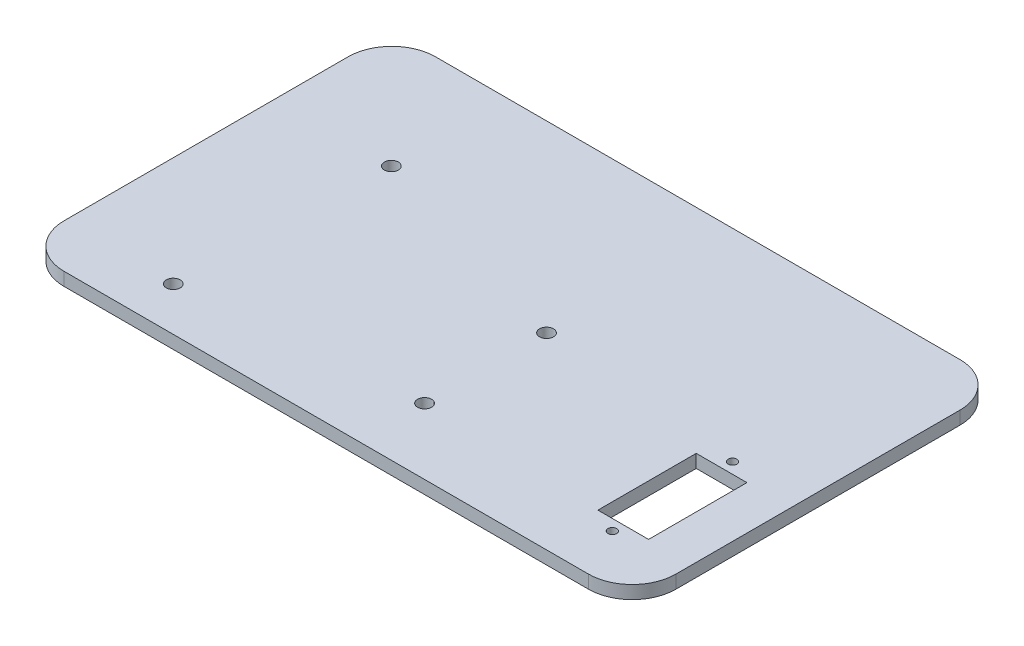
ISO-10303-21;
HEADER;
FILE_DESCRIPTION(('STEP AP214'),'2;1');
FILE_NAME('part.step','',(''),(''),'','','');
FILE_SCHEMA(('AUTOMOTIVE_DESIGN { 1 0 10303 214 1 1 1 1 }'));
ENDSEC;
DATA;
#1=APPLICATION_CONTEXT('core data for automotive mechanical design processes');
#2=APPLICATION_PROTOCOL_DEFINITION('international standard','automotive_design',2000,#1);
#3=PRODUCT_CONTEXT('',#1,'mechanical');
#4=PRODUCT('Part','Part','',(#3));
#5=PRODUCT_RELATED_PRODUCT_CATEGORY('part','',(#4));
#6=PRODUCT_DEFINITION_FORMATION('','',#4);
#7=PRODUCT_DEFINITION_CONTEXT('part definition',#1,'design');
#8=PRODUCT_DEFINITION('design','',#6,#7);
#9=PRODUCT_DEFINITION_SHAPE('','',#8);
#10=(LENGTH_UNIT() NAMED_UNIT(*) SI_UNIT(.MILLI.,.METRE.));
#11=(NAMED_UNIT(*) PLANE_ANGLE_UNIT() SI_UNIT($,.RADIAN.));
#12=(NAMED_UNIT(*) SI_UNIT($,.STERADIAN.) SOLID_ANGLE_UNIT());
#13=UNCERTAINTY_MEASURE_WITH_UNIT(LENGTH_MEASURE(1.E-05),#10,'distance_accuracy_value','');
#14=(GEOMETRIC_REPRESENTATION_CONTEXT(3) GLOBAL_UNCERTAINTY_ASSIGNED_CONTEXT((#13)) GLOBAL_UNIT_ASSIGNED_CONTEXT((#10,
#11,#12)) REPRESENTATION_CONTEXT('',''));
#15=CARTESIAN_POINT('',(0.,0.,0.));
#16=DIRECTION('',(0.,0.,1.));
#17=DIRECTION('',(1.,0.,0.));
#18=AXIS2_PLACEMENT_3D('',#15,#16,#17);
#19=CARTESIAN_POINT('',(-70.,3.,-42.5));
#20=DIRECTION('',(1.,0.,0.));
#21=DIRECTION('',(0.,0.,-1.));
#22=AXIS2_PLACEMENT_3D('',#19,#20,#21);
#23=PLANE('',#22);
#24=DIRECTION('',(0.,0.,1.));
#25=VECTOR('',#24,1.);
#26=CARTESIAN_POINT('',(-70.,3.,-42.5));
#27=LINE('',#26,#25);
#28=CARTESIAN_POINT('',(-70.,3.,-32.5));
#29=VERTEX_POINT('',#28);
#30=CARTESIAN_POINT('',(-70.,3.,32.5));
#31=VERTEX_POINT('',#30);
#32=EDGE_CURVE('E189',#29,#31,#27,.T.);
#33=ORIENTED_EDGE('',*,*,#32,.F.);
#34=DIRECTION('',(0.,-1.,0.));
#35=VECTOR('',#34,1.);
#36=CARTESIAN_POINT('',(-70.,0.,-32.5));
#37=LINE('',#36,#35);
#38=CARTESIAN_POINT('',(-70.,0.,-32.5));
#39=VERTEX_POINT('',#38);
#40=EDGE_CURVE('E221',#29,#39,#37,.T.);
#41=ORIENTED_EDGE('',*,*,#40,.T.);
#42=DIRECTION('',(0.,0.,1.));
#43=VECTOR('',#42,1.);
#44=CARTESIAN_POINT('',(-70.,0.,-42.5));
#45=LINE('',#44,#43);
#46=CARTESIAN_POINT('',(-70.,0.,32.5));
#47=VERTEX_POINT('',#46);
#48=EDGE_CURVE('E168',#39,#47,#45,.T.);
#49=ORIENTED_EDGE('',*,*,#48,.T.);
#50=DIRECTION('',(0.,-1.,0.));
#51=VECTOR('',#50,1.);
#52=CARTESIAN_POINT('',(-70.,3.,32.5));
#53=LINE('',#52,#51);
#54=EDGE_CURVE('E216',#47,#31,#53,.F.);
#55=ORIENTED_EDGE('',*,*,#54,.T.);
#56=EDGE_LOOP('',(#33,#41,#49,#55));
#57=FACE_BOUND('',#56,.T.);
#58=ADVANCED_FACE('F36',(#57),#23,.F.);
#59=CARTESIAN_POINT('',(-70.,3.,42.5));
#60=DIRECTION('',(0.,0.,-1.));
#61=DIRECTION('',(-1.,0.,0.));
#62=AXIS2_PLACEMENT_3D('',#59,#60,#61);
#63=PLANE('',#62);
#64=DIRECTION('',(1.,0.,0.));
#65=VECTOR('',#64,1.);
#66=CARTESIAN_POINT('',(-70.,0.,42.5));
#67=LINE('',#66,#65);
#68=CARTESIAN_POINT('',(-60.,0.,42.5));
#69=VERTEX_POINT('',#68);
#70=CARTESIAN_POINT('',(60.,0.,42.5));
#71=VERTEX_POINT('',#70);
#72=EDGE_CURVE('E203',#69,#71,#67,.T.);
#73=ORIENTED_EDGE('',*,*,#72,.T.);
#74=DIRECTION('',(0.,-1.,0.));
#75=VECTOR('',#74,1.);
#76=CARTESIAN_POINT('',(60.,3.,42.5));
#77=LINE('',#76,#75);
#78=CARTESIAN_POINT('',(60.,3.,42.5));
#79=VERTEX_POINT('',#78);
#80=EDGE_CURVE('E44',#71,#79,#77,.F.);
#81=ORIENTED_EDGE('',*,*,#80,.T.);
#82=DIRECTION('',(1.,0.,0.));
#83=VECTOR('',#82,1.);
#84=CARTESIAN_POINT('',(-70.,3.,42.5));
#85=LINE('',#84,#83);
#86=CARTESIAN_POINT('',(-60.,3.,42.5));
#87=VERTEX_POINT('',#86);
#88=EDGE_CURVE('E191',#87,#79,#85,.T.);
#89=ORIENTED_EDGE('',*,*,#88,.F.);
#90=DIRECTION('',(0.,-1.,0.));
#91=VECTOR('',#90,1.);
#92=CARTESIAN_POINT('',(-60.,3.,42.5));
#93=LINE('',#92,#91);
#94=EDGE_CURVE('E201',#87,#69,#93,.T.);
#95=ORIENTED_EDGE('',*,*,#94,.T.);
#96=EDGE_LOOP('',(#73,#81,#89,#95));
#97=FACE_BOUND('',#96,.T.);
#98=ADVANCED_FACE('F246',(#97),#63,.F.);
#99=CARTESIAN_POINT('',(70.,3.,-42.5));
#100=DIRECTION('',(1.,0.,0.));
#101=DIRECTION('',(0.,0.,-1.));
#102=AXIS2_PLACEMENT_3D('',#99,#100,#101);
#103=PLANE('',#102);
#104=DIRECTION('',(0.,0.,1.));
#105=VECTOR('',#104,1.);
#106=CARTESIAN_POINT('',(70.,3.,-42.5));
#107=LINE('',#106,#105);
#108=CARTESIAN_POINT('',(70.,3.,-32.5));
#109=VERTEX_POINT('',#108);
#110=CARTESIAN_POINT('',(70.,3.,32.5));
#111=VERTEX_POINT('',#110);
#112=EDGE_CURVE('E195',#109,#111,#107,.T.);
#113=ORIENTED_EDGE('',*,*,#112,.T.);
#114=DIRECTION('',(0.,-1.,0.));
#115=VECTOR('',#114,1.);
#116=CARTESIAN_POINT('',(70.,0.,32.5));
#117=LINE('',#116,#115);
#118=CARTESIAN_POINT('',(70.,0.,32.5));
#119=VERTEX_POINT('',#118);
#120=EDGE_CURVE('E239',#111,#119,#117,.T.);
#121=ORIENTED_EDGE('',*,*,#120,.T.);
#122=DIRECTION('',(0.,0.,1.));
#123=VECTOR('',#122,1.);
#124=CARTESIAN_POINT('',(70.,0.,-42.5));
#125=LINE('',#124,#123);
#126=CARTESIAN_POINT('',(70.,0.,-32.5));
#127=VERTEX_POINT('',#126);
#128=EDGE_CURVE('E206',#127,#119,#125,.T.);
#129=ORIENTED_EDGE('',*,*,#128,.F.);
#130=DIRECTION('',(0.,-1.,0.));
#131=VECTOR('',#130,1.);
#132=CARTESIAN_POINT('',(70.,3.,-32.5));
#133=LINE('',#132,#131);
#134=EDGE_CURVE('E235',#127,#109,#133,.F.);
#135=ORIENTED_EDGE('',*,*,#134,.T.);
#136=EDGE_LOOP('',(#113,#121,#129,#135));
#137=FACE_BOUND('',#136,.T.);
#138=ADVANCED_FACE('F258',(#137),#103,.T.);
#139=CARTESIAN_POINT('',(-70.,3.,-42.5));
#140=DIRECTION('',(0.,0.,-1.));
#141=DIRECTION('',(-1.,0.,0.));
#142=AXIS2_PLACEMENT_3D('',#139,#140,#141);
#143=PLANE('',#142);
#144=DIRECTION('',(1.,0.,0.));
#145=VECTOR('',#144,1.);
#146=CARTESIAN_POINT('',(-70.,3.,-42.5));
#147=LINE('',#146,#145);
#148=CARTESIAN_POINT('',(-60.,3.,-42.5));
#149=VERTEX_POINT('',#148);
#150=CARTESIAN_POINT('',(60.,3.,-42.5));
#151=VERTEX_POINT('',#150);
#152=EDGE_CURVE('E198',#149,#151,#147,.T.);
#153=ORIENTED_EDGE('',*,*,#152,.T.);
#154=DIRECTION('',(0.,-1.,0.));
#155=VECTOR('',#154,1.);
#156=CARTESIAN_POINT('',(60.,3.,-42.5));
#157=LINE('',#156,#155);
#158=CARTESIAN_POINT('',(60.,0.,-42.5));
#159=VERTEX_POINT('',#158);
#160=EDGE_CURVE('E230',#151,#159,#157,.T.);
#161=ORIENTED_EDGE('',*,*,#160,.T.);
#162=DIRECTION('',(1.,0.,0.));
#163=VECTOR('',#162,1.);
#164=CARTESIAN_POINT('',(-70.,0.,-42.5));
#165=LINE('',#164,#163);
#166=CARTESIAN_POINT('',(-60.,0.,-42.5));
#167=VERTEX_POINT('',#166);
#168=EDGE_CURVE('E192',#167,#159,#165,.T.);
#169=ORIENTED_EDGE('',*,*,#168,.F.);
#170=DIRECTION('',(0.,-1.,0.));
#171=VECTOR('',#170,1.);
#172=CARTESIAN_POINT('',(-60.,3.,-42.5));
#173=LINE('',#172,#171);
#174=EDGE_CURVE('E226',#167,#149,#173,.F.);
#175=ORIENTED_EDGE('',*,*,#174,.T.);
#176=EDGE_LOOP('',(#153,#161,#169,#175));
#177=FACE_BOUND('',#176,.T.);
#178=ADVANCED_FACE('F267',(#177),#143,.T.);
#179=CARTESIAN_POINT('',(0.,3.,0.));
#180=DIRECTION('',(0.,1.,0.));
#181=DIRECTION('',(0.,0.,1.));
#182=AXIS2_PLACEMENT_3D('',#179,#180,#181);
#183=PLANE('',#182);
#184=CARTESIAN_POINT('',(54.2,3.,3.74999999999998));
#185=DIRECTION('',(0.,1.,0.));
#186=DIRECTION('',(0.,0.,1.));
#187=AXIS2_PLACEMENT_3D('',#184,#185,#186);
#188=CIRCLE('',#187,0.999999999999998);
#189=CARTESIAN_POINT('',(54.2,3.,4.74999999999998));
#190=VERTEX_POINT('',#189);
#191=EDGE_CURVE('E148',#190,#190,#188,.T.);
#192=ORIENTED_EDGE('',*,*,#191,.F.);
#193=EDGE_LOOP('',(#192));
#194=FACE_BOUND('',#193,.T.);
#195=CARTESIAN_POINT('',(54.2,3.,31.25));
#196=DIRECTION('',(0.,1.,0.));
#197=DIRECTION('',(0.,0.,1.));
#198=AXIS2_PLACEMENT_3D('',#195,#196,#197);
#199=CIRCLE('',#198,0.999999999999998);
#200=CARTESIAN_POINT('',(54.2,3.,32.25));
#201=VERTEX_POINT('',#200);
#202=EDGE_CURVE('E344',#201,#201,#199,.T.);
#203=ORIENTED_EDGE('',*,*,#202,.F.);
#204=EDGE_LOOP('',(#203));
#205=FACE_BOUND('',#204,.T.);
#206=DIRECTION('',(0.,0.,1.));
#207=VECTOR('',#206,1.);
#208=CARTESIAN_POINT('',(48.4,3.,28.75));
#209=LINE('',#208,#207);
#210=CARTESIAN_POINT('',(48.4,3.,6.24999999999998));
#211=VERTEX_POINT('',#210);
#212=CARTESIAN_POINT('',(48.4,3.,28.75));
#213=VERTEX_POINT('',#212);
#214=EDGE_CURVE('E51',#211,#213,#209,.T.);
#215=ORIENTED_EDGE('',*,*,#214,.F.);
#216=DIRECTION('',(-1.,0.,0.));
#217=VECTOR('',#216,1.);
#218=CARTESIAN_POINT('',(60.,3.,6.24999999999998));
#219=LINE('',#218,#217);
#220=CARTESIAN_POINT('',(60.,3.,6.24999999999998));
#221=VERTEX_POINT('',#220);
#222=EDGE_CURVE('E142',#221,#211,#219,.T.);
#223=ORIENTED_EDGE('',*,*,#222,.F.);
#224=DIRECTION('',(0.,0.,-1.));
#225=VECTOR('',#224,1.);
#226=CARTESIAN_POINT('',(60.,3.,28.75));
#227=LINE('',#226,#225);
#228=CARTESIAN_POINT('',(60.,3.,28.75));
#229=VERTEX_POINT('',#228);
#230=EDGE_CURVE('E145',#229,#221,#227,.T.);
#231=ORIENTED_EDGE('',*,*,#230,.F.);
#232=DIRECTION('',(1.,0.,0.));
#233=VECTOR('',#232,1.);
#234=CARTESIAN_POINT('',(60.,3.,28.75));
#235=LINE('',#234,#233);
#236=EDGE_CURVE('E154',#213,#229,#235,.T.);
#237=ORIENTED_EDGE('',*,*,#236,.F.);
#238=EDGE_LOOP('',(#215,#223,#231,#237));
#239=FACE_BOUND('',#238,.T.);
#240=CARTESIAN_POINT('',(-43.4,3.,-15.8));
#241=DIRECTION('',(0.,1.,0.));
#242=DIRECTION('',(0.,0.,1.));
#243=AXIS2_PLACEMENT_3D('',#240,#241,#242);
#244=CIRCLE('',#243,1.6);
#245=CARTESIAN_POINT('',(-43.4,3.,-14.2));
#246=VERTEX_POINT('',#245);
#247=EDGE_CURVE('E169',#246,#246,#244,.T.);
#248=ORIENTED_EDGE('',*,*,#247,.F.);
#249=EDGE_LOOP('',(#248));
#250=FACE_BOUND('',#249,.T.);
#251=CARTESIAN_POINT('',(7.39999999999996,3.,27.4));
#252=DIRECTION('',(0.,1.,0.));
#253=DIRECTION('',(0.,0.,1.));
#254=AXIS2_PLACEMENT_3D('',#251,#252,#253);
#255=CIRCLE('',#254,1.60000000000001);
#256=CARTESIAN_POINT('',(7.39999999999996,3.,29.));
#257=VERTEX_POINT('',#256);
#258=EDGE_CURVE('E161',#257,#257,#255,.T.);
#259=ORIENTED_EDGE('',*,*,#258,.F.);
#260=EDGE_LOOP('',(#259));
#261=FACE_BOUND('',#260,.T.);
#262=CARTESIAN_POINT('',(-45.,3.,32.5));
#263=DIRECTION('',(0.,1.,0.));
#264=DIRECTION('',(0.,0.,1.));
#265=AXIS2_PLACEMENT_3D('',#262,#263,#264);
#266=CIRCLE('',#265,1.6);
#267=CARTESIAN_POINT('',(-45.,3.,34.1));
#268=VERTEX_POINT('',#267);
#269=EDGE_CURVE('E176',#268,#268,#266,.T.);
#270=ORIENTED_EDGE('',*,*,#269,.F.);
#271=EDGE_LOOP('',(#270));
#272=FACE_BOUND('',#271,.T.);
#273=CARTESIAN_POINT('',(7.39999999999996,3.,-0.500000000000018));
#274=DIRECTION('',(0.,1.,0.));
#275=DIRECTION('',(0.,0.,1.));
#276=AXIS2_PLACEMENT_3D('',#273,#274,#275);
#277=CIRCLE('',#276,1.60000000000001);
#278=CARTESIAN_POINT('',(7.39999999999996,3.,1.09999999999999));
#279=VERTEX_POINT('',#278);
#280=EDGE_CURVE('E181',#279,#279,#277,.T.);
#281=ORIENTED_EDGE('',*,*,#280,.F.);
#282=EDGE_LOOP('',(#281));
#283=FACE_BOUND('',#282,.T.);
#284=ORIENTED_EDGE('',*,*,#88,.T.);
#285=CARTESIAN_POINT('',(60.,3.,32.5));
#286=DIRECTION('',(0.,1.,0.));
#287=DIRECTION('',(0.,0.,1.));
#288=AXIS2_PLACEMENT_3D('',#285,#286,#287);
#289=CIRCLE('',#288,10.);
#290=EDGE_CURVE('E11',#79,#111,#289,.T.);
#291=ORIENTED_EDGE('',*,*,#290,.T.);
#292=ORIENTED_EDGE('',*,*,#112,.F.);
#293=CARTESIAN_POINT('',(60.,3.,-32.5));
#294=DIRECTION('',(0.,1.,0.));
#295=DIRECTION('',(0.,0.,1.));
#296=AXIS2_PLACEMENT_3D('',#293,#294,#295);
#297=CIRCLE('',#296,10.);
#298=EDGE_CURVE('E237',#109,#151,#297,.T.);
#299=ORIENTED_EDGE('',*,*,#298,.T.);
#300=ORIENTED_EDGE('',*,*,#152,.F.);
#301=CARTESIAN_POINT('',(-60.,3.,-32.5));
#302=DIRECTION('',(0.,1.,0.));
#303=DIRECTION('',(0.,0.,1.));
#304=AXIS2_PLACEMENT_3D('',#301,#302,#303);
#305=CIRCLE('',#304,10.);
#306=EDGE_CURVE('E228',#149,#29,#305,.T.);
#307=ORIENTED_EDGE('',*,*,#306,.T.);
#308=ORIENTED_EDGE('',*,*,#32,.T.);
#309=CARTESIAN_POINT('',(-60.,3.,32.5));
#310=DIRECTION('',(0.,1.,0.));
#311=DIRECTION('',(0.,0.,1.));
#312=AXIS2_PLACEMENT_3D('',#309,#310,#311);
#313=CIRCLE('',#312,10.);
#314=EDGE_CURVE('E219',#31,#87,#313,.T.);
#315=ORIENTED_EDGE('',*,*,#314,.T.);
#316=EDGE_LOOP('',(#284,#291,#292,#299,#300,#307,#308,#315));
#317=FACE_BOUND('',#316,.T.);
#318=ADVANCED_FACE('F252',(#194,#205,#239,#250,#261,#272,#283,#317),#183,.T.);
#319=CARTESIAN_POINT('',(0.,0.,0.));
#320=DIRECTION('',(0.,1.,0.));
#321=DIRECTION('',(0.,0.,1.));
#322=AXIS2_PLACEMENT_3D('',#319,#320,#321);
#323=PLANE('',#322);
#324=CARTESIAN_POINT('',(54.2,0.,3.74999999999998));
#325=DIRECTION('',(0.,1.,0.));
#326=DIRECTION('',(0.,0.,1.));
#327=AXIS2_PLACEMENT_3D('',#324,#325,#326);
#328=CIRCLE('',#327,0.999999999999998);
#329=CARTESIAN_POINT('',(54.2,0.,4.74999999999998));
#330=VERTEX_POINT('',#329);
#331=EDGE_CURVE('E346',#330,#330,#328,.T.);
#332=ORIENTED_EDGE('',*,*,#331,.T.);
#333=EDGE_LOOP('',(#332));
#334=FACE_BOUND('',#333,.T.);
#335=CARTESIAN_POINT('',(54.2,0.,31.25));
#336=DIRECTION('',(0.,1.,0.));
#337=DIRECTION('',(0.,0.,1.));
#338=AXIS2_PLACEMENT_3D('',#335,#336,#337);
#339=CIRCLE('',#338,0.999999999999998);
#340=CARTESIAN_POINT('',(54.2,0.,32.25));
#341=VERTEX_POINT('',#340);
#342=EDGE_CURVE('E155',#341,#341,#339,.T.);
#343=ORIENTED_EDGE('',*,*,#342,.T.);
#344=EDGE_LOOP('',(#343));
#345=FACE_BOUND('',#344,.T.);
#346=DIRECTION('',(-1.,0.,0.));
#347=VECTOR('',#346,1.);
#348=CARTESIAN_POINT('',(60.,0.,6.24999999999998));
#349=LINE('',#348,#347);
#350=CARTESIAN_POINT('',(60.,0.,6.24999999999998));
#351=VERTEX_POINT('',#350);
#352=CARTESIAN_POINT('',(48.4,0.,6.24999999999998));
#353=VERTEX_POINT('',#352);
#354=EDGE_CURVE('E132',#351,#353,#349,.T.);
#355=ORIENTED_EDGE('',*,*,#354,.T.);
#356=DIRECTION('',(0.,0.,1.));
#357=VECTOR('',#356,1.);
#358=CARTESIAN_POINT('',(48.4,0.,28.75));
#359=LINE('',#358,#357);
#360=CARTESIAN_POINT('',(48.4,0.,28.75));
#361=VERTEX_POINT('',#360);
#362=EDGE_CURVE('E126',#353,#361,#359,.T.);
#363=ORIENTED_EDGE('',*,*,#362,.T.);
#364=DIRECTION('',(1.,0.,0.));
#365=VECTOR('',#364,1.);
#366=CARTESIAN_POINT('',(60.,0.,28.75));
#367=LINE('',#366,#365);
#368=CARTESIAN_POINT('',(60.,0.,28.75));
#369=VERTEX_POINT('',#368);
#370=EDGE_CURVE('E135',#361,#369,#367,.T.);
#371=ORIENTED_EDGE('',*,*,#370,.T.);
#372=DIRECTION('',(0.,0.,-1.));
#373=VECTOR('',#372,1.);
#374=CARTESIAN_POINT('',(60.,0.,28.75));
#375=LINE('',#374,#373);
#376=EDGE_CURVE('E59',#369,#351,#375,.T.);
#377=ORIENTED_EDGE('',*,*,#376,.T.);
#378=EDGE_LOOP('',(#355,#363,#371,#377));
#379=FACE_BOUND('',#378,.T.);
#380=CARTESIAN_POINT('',(-43.4,0.,-15.8));
#381=DIRECTION('',(0.,1.,0.));
#382=DIRECTION('',(0.,0.,1.));
#383=AXIS2_PLACEMENT_3D('',#380,#381,#382);
#384=CIRCLE('',#383,1.6);
#385=CARTESIAN_POINT('',(-43.4,0.,-14.2));
#386=VERTEX_POINT('',#385);
#387=EDGE_CURVE('E165',#386,#386,#384,.T.);
#388=ORIENTED_EDGE('',*,*,#387,.T.);
#389=EDGE_LOOP('',(#388));
#390=FACE_BOUND('',#389,.T.);
#391=CARTESIAN_POINT('',(7.39999999999996,0.,27.4));
#392=DIRECTION('',(0.,1.,0.));
#393=DIRECTION('',(0.,0.,1.));
#394=AXIS2_PLACEMENT_3D('',#391,#392,#393);
#395=CIRCLE('',#394,1.60000000000001);
#396=CARTESIAN_POINT('',(7.39999999999996,0.,29.));
#397=VERTEX_POINT('',#396);
#398=EDGE_CURVE('E173',#397,#397,#395,.T.);
#399=ORIENTED_EDGE('',*,*,#398,.T.);
#400=EDGE_LOOP('',(#399));
#401=FACE_BOUND('',#400,.T.);
#402=CARTESIAN_POINT('',(-45.,0.,32.5));
#403=DIRECTION('',(0.,1.,0.));
#404=DIRECTION('',(0.,0.,1.));
#405=AXIS2_PLACEMENT_3D('',#402,#403,#404);
#406=CIRCLE('',#405,1.6);
#407=CARTESIAN_POINT('',(-45.,0.,34.1));
#408=VERTEX_POINT('',#407);
#409=EDGE_CURVE('E184',#408,#408,#406,.T.);
#410=ORIENTED_EDGE('',*,*,#409,.T.);
#411=EDGE_LOOP('',(#410));
#412=FACE_BOUND('',#411,.T.);
#413=CARTESIAN_POINT('',(7.39999999999996,0.,-0.500000000000018));
#414=DIRECTION('',(0.,1.,0.));
#415=DIRECTION('',(0.,0.,1.));
#416=AXIS2_PLACEMENT_3D('',#413,#414,#415);
#417=CIRCLE('',#416,1.60000000000001);
#418=CARTESIAN_POINT('',(7.39999999999996,0.,1.09999999999999));
#419=VERTEX_POINT('',#418);
#420=EDGE_CURVE('E172',#419,#419,#417,.T.);
#421=ORIENTED_EDGE('',*,*,#420,.T.);
#422=EDGE_LOOP('',(#421));
#423=FACE_BOUND('',#422,.T.);
#424=ORIENTED_EDGE('',*,*,#128,.T.);
#425=CARTESIAN_POINT('',(60.,0.,32.5));
#426=DIRECTION('',(0.,1.,0.));
#427=DIRECTION('',(0.,0.,1.));
#428=AXIS2_PLACEMENT_3D('',#425,#426,#427);
#429=CIRCLE('',#428,10.);
#430=EDGE_CURVE('E242',#119,#71,#429,.F.);
#431=ORIENTED_EDGE('',*,*,#430,.T.);
#432=ORIENTED_EDGE('',*,*,#72,.F.);
#433=CARTESIAN_POINT('',(-60.,0.,32.5));
#434=DIRECTION('',(0.,1.,0.));
#435=DIRECTION('',(0.,0.,1.));
#436=AXIS2_PLACEMENT_3D('',#433,#434,#435);
#437=CIRCLE('',#436,10.);
#438=EDGE_CURVE('E213',#69,#47,#437,.F.);
#439=ORIENTED_EDGE('',*,*,#438,.T.);
#440=ORIENTED_EDGE('',*,*,#48,.F.);
#441=CARTESIAN_POINT('',(-60.,0.,-32.5));
#442=DIRECTION('',(0.,1.,0.));
#443=DIRECTION('',(0.,0.,1.));
#444=AXIS2_PLACEMENT_3D('',#441,#442,#443);
#445=CIRCLE('',#444,10.);
#446=EDGE_CURVE('E224',#39,#167,#445,.F.);
#447=ORIENTED_EDGE('',*,*,#446,.T.);
#448=ORIENTED_EDGE('',*,*,#168,.T.);
#449=CARTESIAN_POINT('',(60.,0.,-32.5));
#450=DIRECTION('',(0.,1.,0.));
#451=DIRECTION('',(0.,0.,1.));
#452=AXIS2_PLACEMENT_3D('',#449,#450,#451);
#453=CIRCLE('',#452,10.);
#454=EDGE_CURVE('E233',#159,#127,#453,.F.);
#455=ORIENTED_EDGE('',*,*,#454,.T.);
#456=EDGE_LOOP('',(#424,#431,#432,#439,#440,#447,#448,#455));
#457=FACE_BOUND('',#456,.T.);
#458=ADVANCED_FACE('F139',(#334,#345,#379,#390,#401,#412,#423,#457),#323,.F.);
#459=CARTESIAN_POINT('',(7.39999999999996,0.,-0.500000000000018));
#460=DIRECTION('',(0.,1.,0.));
#461=DIRECTION('',(0.,0.,1.));
#462=AXIS2_PLACEMENT_3D('',#459,#460,#461);
#463=CYLINDRICAL_SURFACE('',#462,1.60000000000001);
#464=ORIENTED_EDGE('',*,*,#420,.F.);
#465=EDGE_LOOP('',(#464));
#466=FACE_BOUND('',#465,.T.);
#467=ORIENTED_EDGE('',*,*,#280,.T.);
#468=EDGE_LOOP('',(#467));
#469=FACE_BOUND('',#468,.T.);
#470=ADVANCED_FACE('F304',(#466,#469),#463,.F.);
#471=CARTESIAN_POINT('',(-45.,0.,32.5));
#472=DIRECTION('',(0.,1.,0.));
#473=DIRECTION('',(0.,0.,1.));
#474=AXIS2_PLACEMENT_3D('',#471,#472,#473);
#475=CYLINDRICAL_SURFACE('',#474,1.6);
#476=ORIENTED_EDGE('',*,*,#409,.F.);
#477=EDGE_LOOP('',(#476));
#478=FACE_BOUND('',#477,.T.);
#479=ORIENTED_EDGE('',*,*,#269,.T.);
#480=EDGE_LOOP('',(#479));
#481=FACE_BOUND('',#480,.T.);
#482=ADVANCED_FACE('F309',(#478,#481),#475,.F.);
#483=CARTESIAN_POINT('',(7.39999999999996,0.,27.4));
#484=DIRECTION('',(0.,1.,0.));
#485=DIRECTION('',(0.,0.,1.));
#486=AXIS2_PLACEMENT_3D('',#483,#484,#485);
#487=CYLINDRICAL_SURFACE('',#486,1.60000000000001);
#488=ORIENTED_EDGE('',*,*,#398,.F.);
#489=EDGE_LOOP('',(#488));
#490=FACE_BOUND('',#489,.T.);
#491=ORIENTED_EDGE('',*,*,#258,.T.);
#492=EDGE_LOOP('',(#491));
#493=FACE_BOUND('',#492,.T.);
#494=ADVANCED_FACE('F288',(#490,#493),#487,.F.);
#495=CARTESIAN_POINT('',(-43.4,0.,-15.8));
#496=DIRECTION('',(0.,1.,0.));
#497=DIRECTION('',(0.,0.,1.));
#498=AXIS2_PLACEMENT_3D('',#495,#496,#497);
#499=CYLINDRICAL_SURFACE('',#498,1.6);
#500=ORIENTED_EDGE('',*,*,#387,.F.);
#501=EDGE_LOOP('',(#500));
#502=FACE_BOUND('',#501,.T.);
#503=ORIENTED_EDGE('',*,*,#247,.T.);
#504=EDGE_LOOP('',(#503));
#505=FACE_BOUND('',#504,.T.);
#506=ADVANCED_FACE('F281',(#502,#505),#499,.F.);
#507=CARTESIAN_POINT('',(-60.,3.,32.5));
#508=DIRECTION('',(0.,-1.,0.));
#509=DIRECTION('',(0.,0.,-1.));
#510=AXIS2_PLACEMENT_3D('',#507,#508,#509);
#511=CYLINDRICAL_SURFACE('',#510,10.);
#512=ORIENTED_EDGE('',*,*,#314,.F.);
#513=ORIENTED_EDGE('',*,*,#54,.F.);
#514=ORIENTED_EDGE('',*,*,#438,.F.);
#515=ORIENTED_EDGE('',*,*,#94,.F.);
#516=EDGE_LOOP('',(#512,#513,#514,#515));
#517=FACE_BOUND('',#516,.T.);
#518=ADVANCED_FACE('F279',(#517),#511,.T.);
#519=CARTESIAN_POINT('',(-60.,3.,-32.5));
#520=DIRECTION('',(0.,1.,0.));
#521=DIRECTION('',(0.,0.,1.));
#522=AXIS2_PLACEMENT_3D('',#519,#520,#521);
#523=CYLINDRICAL_SURFACE('',#522,10.);
#524=ORIENTED_EDGE('',*,*,#306,.F.);
#525=ORIENTED_EDGE('',*,*,#174,.F.);
#526=ORIENTED_EDGE('',*,*,#446,.F.);
#527=ORIENTED_EDGE('',*,*,#40,.F.);
#528=EDGE_LOOP('',(#524,#525,#526,#527));
#529=FACE_BOUND('',#528,.T.);
#530=ADVANCED_FACE('F274',(#529),#523,.T.);
#531=CARTESIAN_POINT('',(60.,3.,-32.5));
#532=DIRECTION('',(0.,-1.,0.));
#533=DIRECTION('',(0.,0.,-1.));
#534=AXIS2_PLACEMENT_3D('',#531,#532,#533);
#535=CYLINDRICAL_SURFACE('',#534,10.);
#536=ORIENTED_EDGE('',*,*,#298,.F.);
#537=ORIENTED_EDGE('',*,*,#134,.F.);
#538=ORIENTED_EDGE('',*,*,#454,.F.);
#539=ORIENTED_EDGE('',*,*,#160,.F.);
#540=EDGE_LOOP('',(#536,#537,#538,#539));
#541=FACE_BOUND('',#540,.T.);
#542=ADVANCED_FACE('F265',(#541),#535,.T.);
#543=CARTESIAN_POINT('',(60.,3.,32.5));
#544=DIRECTION('',(0.,1.,0.));
#545=DIRECTION('',(0.,0.,1.));
#546=AXIS2_PLACEMENT_3D('',#543,#544,#545);
#547=CYLINDRICAL_SURFACE('',#546,10.);
#548=ORIENTED_EDGE('',*,*,#290,.F.);
#549=ORIENTED_EDGE('',*,*,#80,.F.);
#550=ORIENTED_EDGE('',*,*,#430,.F.);
#551=ORIENTED_EDGE('',*,*,#120,.F.);
#552=EDGE_LOOP('',(#548,#549,#550,#551));
#553=FACE_BOUND('',#552,.T.);
#554=ADVANCED_FACE('F38',(#553),#547,.T.);
#555=CARTESIAN_POINT('',(48.4,0.,28.75));
#556=DIRECTION('',(-1.,0.,0.));
#557=DIRECTION('',(0.,0.,1.));
#558=AXIS2_PLACEMENT_3D('',#555,#556,#557);
#559=PLANE('',#558);
#560=ORIENTED_EDGE('',*,*,#214,.T.);
#561=DIRECTION('',(0.,1.,0.));
#562=VECTOR('',#561,1.);
#563=CARTESIAN_POINT('',(48.4,0.,28.75));
#564=LINE('',#563,#562);
#565=EDGE_CURVE('E122',#361,#213,#564,.T.);
#566=ORIENTED_EDGE('',*,*,#565,.F.);
#567=ORIENTED_EDGE('',*,*,#362,.F.);
#568=DIRECTION('',(0.,1.,0.));
#569=VECTOR('',#568,1.);
#570=CARTESIAN_POINT('',(48.4,0.,6.24999999999998));
#571=LINE('',#570,#569);
#572=EDGE_CURVE('E159',#353,#211,#571,.T.);
#573=ORIENTED_EDGE('',*,*,#572,.T.);
#574=EDGE_LOOP('',(#560,#566,#567,#573));
#575=FACE_BOUND('',#574,.T.);
#576=ADVANCED_FACE('F124',(#575),#559,.F.);
#577=CARTESIAN_POINT('',(60.,0.,6.24999999999998));
#578=DIRECTION('',(0.,0.,-1.));
#579=DIRECTION('',(-1.,0.,0.));
#580=AXIS2_PLACEMENT_3D('',#577,#578,#579);
#581=PLANE('',#580);
#582=ORIENTED_EDGE('',*,*,#222,.T.);
#583=ORIENTED_EDGE('',*,*,#572,.F.);
#584=ORIENTED_EDGE('',*,*,#354,.F.);
#585=DIRECTION('',(0.,1.,0.));
#586=VECTOR('',#585,1.);
#587=CARTESIAN_POINT('',(60.,0.,6.24999999999998));
#588=LINE('',#587,#586);
#589=EDGE_CURVE('E162',#351,#221,#588,.T.);
#590=ORIENTED_EDGE('',*,*,#589,.T.);
#591=EDGE_LOOP('',(#582,#583,#584,#590));
#592=FACE_BOUND('',#591,.T.);
#593=ADVANCED_FACE('F321',(#592),#581,.F.);
#594=CARTESIAN_POINT('',(60.,0.,28.75));
#595=DIRECTION('',(1.,0.,0.));
#596=DIRECTION('',(0.,0.,-1.));
#597=AXIS2_PLACEMENT_3D('',#594,#595,#596);
#598=PLANE('',#597);
#599=ORIENTED_EDGE('',*,*,#230,.T.);
#600=ORIENTED_EDGE('',*,*,#589,.F.);
#601=ORIENTED_EDGE('',*,*,#376,.F.);
#602=DIRECTION('',(0.,1.,0.));
#603=VECTOR('',#602,1.);
#604=CARTESIAN_POINT('',(60.,0.,28.75));
#605=LINE('',#604,#603);
#606=EDGE_CURVE('E131',#369,#229,#605,.T.);
#607=ORIENTED_EDGE('',*,*,#606,.T.);
#608=EDGE_LOOP('',(#599,#600,#601,#607));
#609=FACE_BOUND('',#608,.T.);
#610=ADVANCED_FACE('F325',(#609),#598,.F.);
#611=CARTESIAN_POINT('',(60.,0.,28.75));
#612=DIRECTION('',(0.,0.,1.));
#613=DIRECTION('',(1.,0.,0.));
#614=AXIS2_PLACEMENT_3D('',#611,#612,#613);
#615=PLANE('',#614);
#616=ORIENTED_EDGE('',*,*,#236,.T.);
#617=ORIENTED_EDGE('',*,*,#606,.F.);
#618=ORIENTED_EDGE('',*,*,#370,.F.);
#619=ORIENTED_EDGE('',*,*,#565,.T.);
#620=EDGE_LOOP('',(#616,#617,#618,#619));
#621=FACE_BOUND('',#620,.T.);
#622=ADVANCED_FACE('F136',(#621),#615,.F.);
#623=CARTESIAN_POINT('',(54.2,0.,31.25));
#624=DIRECTION('',(0.,1.,0.));
#625=DIRECTION('',(0.,0.,1.));
#626=AXIS2_PLACEMENT_3D('',#623,#624,#625);
#627=CYLINDRICAL_SURFACE('',#626,0.999999999999998);
#628=ORIENTED_EDGE('',*,*,#342,.F.);
#629=EDGE_LOOP('',(#628));
#630=FACE_BOUND('',#629,.T.);
#631=ORIENTED_EDGE('',*,*,#202,.T.);
#632=EDGE_LOOP('',(#631));
#633=FACE_BOUND('',#632,.T.);
#634=ADVANCED_FACE('F324',(#630,#633),#627,.F.);
#635=CARTESIAN_POINT('',(54.2,0.,3.74999999999998));
#636=DIRECTION('',(0.,1.,0.));
#637=DIRECTION('',(0.,0.,1.));
#638=AXIS2_PLACEMENT_3D('',#635,#636,#637);
#639=CYLINDRICAL_SURFACE('',#638,0.999999999999998);
#640=ORIENTED_EDGE('',*,*,#331,.F.);
#641=EDGE_LOOP('',(#640));
#642=FACE_BOUND('',#641,.T.);
#643=ORIENTED_EDGE('',*,*,#191,.T.);
#644=EDGE_LOOP('',(#643));
#645=FACE_BOUND('',#644,.T.);
#646=ADVANCED_FACE('F331',(#642,#645),#639,.F.);
#647=CLOSED_SHELL('',(#58,#98,#138,#178,#318,#458,#470,#482,#494,#506,#518,#530,#542,#554,#576,
#593,#610,#622,#634,#646));
#648=MANIFOLD_SOLID_BREP('B2',#647);
#649=ADVANCED_BREP_SHAPE_REPRESENTATION('',(#18,#648),#14);
#650=SHAPE_DEFINITION_REPRESENTATION(#9,#649);
ENDSEC;
END-ISO-10303-21;
